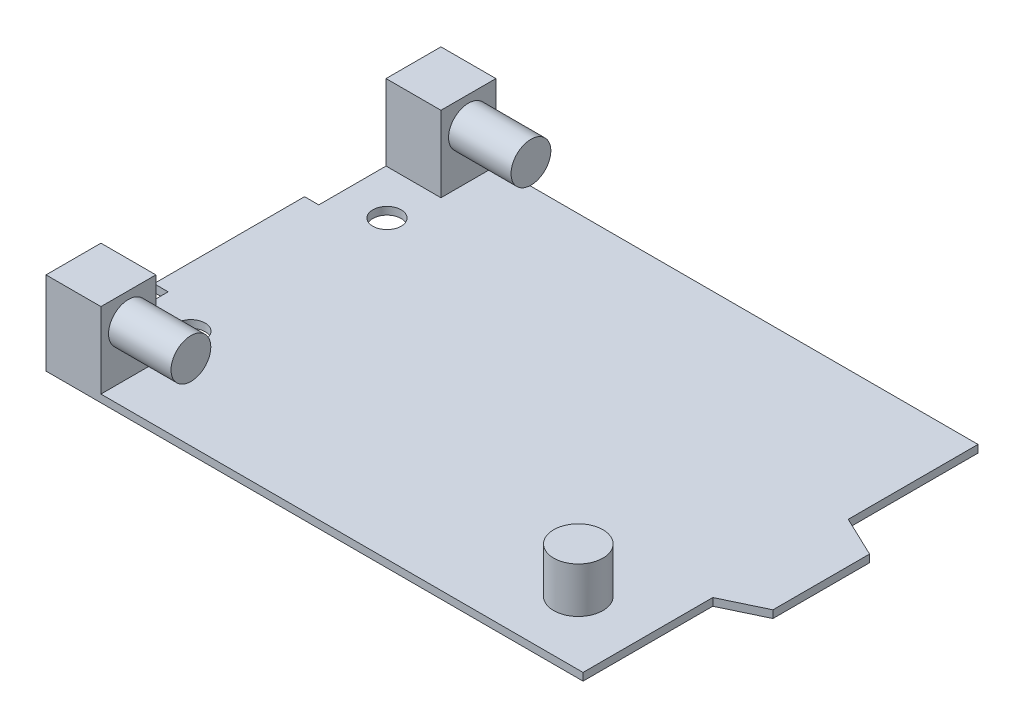
ISO-10303-21;
HEADER;
FILE_DESCRIPTION(('STEP AP214'),'2;1');
FILE_NAME('part.step','',(''),(''),'','','');
FILE_SCHEMA(('AUTOMOTIVE_DESIGN { 1 0 10303 214 1 1 1 1 }'));
ENDSEC;
DATA;
#1=APPLICATION_CONTEXT('core data for automotive mechanical design processes');
#2=APPLICATION_PROTOCOL_DEFINITION('international standard','automotive_design',2000,#1);
#3=PRODUCT_CONTEXT('',#1,'mechanical');
#4=PRODUCT('Part','Part','',(#3));
#5=PRODUCT_RELATED_PRODUCT_CATEGORY('part','',(#4));
#6=PRODUCT_DEFINITION_FORMATION('','',#4);
#7=PRODUCT_DEFINITION_CONTEXT('part definition',#1,'design');
#8=PRODUCT_DEFINITION('design','',#6,#7);
#9=PRODUCT_DEFINITION_SHAPE('','',#8);
#10=(LENGTH_UNIT() NAMED_UNIT(*) SI_UNIT(.MILLI.,.METRE.));
#11=(NAMED_UNIT(*) PLANE_ANGLE_UNIT() SI_UNIT($,.RADIAN.));
#12=(NAMED_UNIT(*) SI_UNIT($,.STERADIAN.) SOLID_ANGLE_UNIT());
#13=UNCERTAINTY_MEASURE_WITH_UNIT(LENGTH_MEASURE(1.E-05),#10,'distance_accuracy_value','');
#14=(GEOMETRIC_REPRESENTATION_CONTEXT(3) GLOBAL_UNCERTAINTY_ASSIGNED_CONTEXT((#13)) GLOBAL_UNIT_ASSIGNED_CONTEXT((#10,
#11,#12)) REPRESENTATION_CONTEXT('',''));
#15=CARTESIAN_POINT('',(0.,0.,0.));
#16=DIRECTION('',(0.,0.,1.));
#17=DIRECTION('',(1.,0.,0.));
#18=AXIS2_PLACEMENT_3D('',#15,#16,#17);
#19=CARTESIAN_POINT('',(0.,1.016,0.));
#20=DIRECTION('',(0.,-1.,0.));
#21=DIRECTION('',(0.,0.,-1.));
#22=AXIS2_PLACEMENT_3D('',#19,#20,#21);
#23=PLANE('',#22);
#24=CARTESIAN_POINT('',(64.77,1.016,7.874));
#25=DIRECTION('',(0.,-1.,0.));
#26=DIRECTION('',(0.,0.,-1.));
#27=AXIS2_PLACEMENT_3D('',#24,#25,#26);
#28=CIRCLE('',#27,3.302);
#29=CARTESIAN_POINT('',(64.77,1.016,4.572));
#30=VERTEX_POINT('',#29);
#31=EDGE_CURVE('E11',#30,#30,#28,.F.);
#32=ORIENTED_EDGE('',*,*,#31,.F.);
#33=EDGE_LOOP('',(#32));
#34=FACE_BOUND('',#33,.T.);
#35=CARTESIAN_POINT('',(8.001,1.016,3.048));
#36=DIRECTION('',(0.,1.,0.));
#37=DIRECTION('',(0.,0.,1.));
#38=AXIS2_PLACEMENT_3D('',#35,#36,#37);
#39=CIRCLE('',#38,1.905);
#40=CARTESIAN_POINT('',(8.001,1.016,4.953));
#41=VERTEX_POINT('',#40);
#42=EDGE_CURVE('E234',#41,#41,#39,.T.);
#43=ORIENTED_EDGE('',*,*,#42,.F.);
#44=EDGE_LOOP('',(#43));
#45=FACE_BOUND('',#44,.T.);
#46=CARTESIAN_POINT('',(8.00099999999999,1.016,-23.241));
#47=DIRECTION('',(0.,1.,0.));
#48=DIRECTION('',(0.,0.,1.));
#49=AXIS2_PLACEMENT_3D('',#46,#47,#48);
#50=CIRCLE('',#49,1.905);
#51=CARTESIAN_POINT('',(8.00099999999999,1.016,-21.336));
#52=VERTEX_POINT('',#51);
#53=EDGE_CURVE('E228',#52,#52,#50,.T.);
#54=ORIENTED_EDGE('',*,*,#53,.F.);
#55=EDGE_LOOP('',(#54));
#56=FACE_BOUND('',#55,.T.);
#57=DIRECTION('',(0.,0.,-1.));
#58=VECTOR('',#57,1.);
#59=CARTESIAN_POINT('',(9.271,1.016,16.383));
#60=LINE('',#59,#58);
#61=CARTESIAN_POINT('',(9.271,1.016,16.383));
#62=VERTEX_POINT('',#61);
#63=CARTESIAN_POINT('',(9.271,1.016,9.017));
#64=VERTEX_POINT('',#63);
#65=EDGE_CURVE('E174',#62,#64,#60,.T.);
#66=ORIENTED_EDGE('',*,*,#65,.F.);
#67=DIRECTION('',(1.,0.,0.));
#68=VECTOR('',#67,1.);
#69=CARTESIAN_POINT('',(1.905,1.016,16.383));
#70=LINE('',#69,#68);
#71=CARTESIAN_POINT('',(73.914,1.016,16.383));
#72=VERTEX_POINT('',#71);
#73=EDGE_CURVE('E163',#62,#72,#70,.T.);
#74=ORIENTED_EDGE('',*,*,#73,.T.);
#75=DIRECTION('',(0.,0.,-1.));
#76=VECTOR('',#75,1.);
#77=CARTESIAN_POINT('',(73.914,1.016,16.383));
#78=LINE('',#77,#76);
#79=CARTESIAN_POINT('',(73.914,1.016,-1.016));
#80=VERTEX_POINT('',#79);
#81=EDGE_CURVE('E172',#72,#80,#78,.T.);
#82=ORIENTED_EDGE('',*,*,#81,.T.);
#83=DIRECTION('',(0.902666413566439,0.,-0.430340964607255));
#84=VECTOR('',#83,1.);
#85=CARTESIAN_POINT('',(73.914,1.016,-1.016));
#86=LINE('',#85,#84);
#87=CARTESIAN_POINT('',(79.375,1.016,-3.6195));
#88=VERTEX_POINT('',#87);
#89=EDGE_CURVE('E245',#80,#88,#86,.T.);
#90=ORIENTED_EDGE('',*,*,#89,.T.);
#91=DIRECTION('',(0.,0.,-1.));
#92=VECTOR('',#91,1.);
#93=CARTESIAN_POINT('',(79.375,1.016,-3.6195));
#94=LINE('',#93,#92);
#95=CARTESIAN_POINT('',(79.375,1.016,-16.5735));
#96=VERTEX_POINT('',#95);
#97=EDGE_CURVE('E247',#88,#96,#94,.T.);
#98=ORIENTED_EDGE('',*,*,#97,.T.);
#99=DIRECTION('',(-0.902666413566438,0.,-0.430340964607256));
#100=VECTOR('',#99,1.);
#101=CARTESIAN_POINT('',(79.375,1.016,-16.5735));
#102=LINE('',#101,#100);
#103=CARTESIAN_POINT('',(73.914,1.016,-19.177));
#104=VERTEX_POINT('',#103);
#105=EDGE_CURVE('E249',#96,#104,#102,.T.);
#106=ORIENTED_EDGE('',*,*,#105,.T.);
#107=DIRECTION('',(0.,0.,-1.));
#108=VECTOR('',#107,1.);
#109=CARTESIAN_POINT('',(73.914,1.016,-19.177));
#110=LINE('',#109,#108);
#111=CARTESIAN_POINT('',(73.914,1.016,-36.576));
#112=VERTEX_POINT('',#111);
#113=EDGE_CURVE('E251',#104,#112,#110,.T.);
#114=ORIENTED_EDGE('',*,*,#113,.T.);
#115=DIRECTION('',(-1.,0.,0.));
#116=VECTOR('',#115,1.);
#117=CARTESIAN_POINT('',(73.914,1.016,-36.576));
#118=LINE('',#117,#116);
#119=CARTESIAN_POINT('',(9.271,1.016,-36.576));
#120=VERTEX_POINT('',#119);
#121=EDGE_CURVE('E253',#112,#120,#118,.T.);
#122=ORIENTED_EDGE('',*,*,#121,.T.);
#123=DIRECTION('',(0.,0.,-1.));
#124=VECTOR('',#123,1.);
#125=CARTESIAN_POINT('',(9.271,1.016,-36.576));
#126=LINE('',#125,#124);
#127=CARTESIAN_POINT('',(9.271,1.016,-29.21));
#128=VERTEX_POINT('',#127);
#129=EDGE_CURVE('E207',#128,#120,#126,.T.);
#130=ORIENTED_EDGE('',*,*,#129,.F.);
#131=DIRECTION('',(1.,0.,0.));
#132=VECTOR('',#131,1.);
#133=CARTESIAN_POINT('',(1.905,1.016,-29.21));
#134=LINE('',#133,#132);
#135=CARTESIAN_POINT('',(1.905,1.016,-29.21));
#136=VERTEX_POINT('',#135);
#137=EDGE_CURVE('E178',#136,#128,#134,.T.);
#138=ORIENTED_EDGE('',*,*,#137,.F.);
#139=DIRECTION('',(0.,0.,1.));
#140=VECTOR('',#139,1.);
#141=CARTESIAN_POINT('',(1.905,1.016,-20.193));
#142=LINE('',#141,#140);
#143=CARTESIAN_POINT('',(1.905,1.016,-20.193));
#144=VERTEX_POINT('',#143);
#145=EDGE_CURVE('E255',#136,#144,#142,.T.);
#146=ORIENTED_EDGE('',*,*,#145,.T.);
#147=DIRECTION('',(-1.,0.,0.));
#148=VECTOR('',#147,1.);
#149=CARTESIAN_POINT('',(0.,1.016,-20.193));
#150=LINE('',#149,#148);
#151=CARTESIAN_POINT('',(0.,1.016,-20.193));
#152=VERTEX_POINT('',#151);
#153=EDGE_CURVE('E257',#144,#152,#150,.T.);
#154=ORIENTED_EDGE('',*,*,#153,.T.);
#155=DIRECTION('',(0.,0.,1.));
#156=VECTOR('',#155,1.);
#157=CARTESIAN_POINT('',(0.,1.016,0.));
#158=LINE('',#157,#156);
#159=CARTESIAN_POINT('',(0.,1.016,0.));
#160=VERTEX_POINT('',#159);
#161=EDGE_CURVE('E259',#152,#160,#158,.T.);
#162=ORIENTED_EDGE('',*,*,#161,.T.);
#163=DIRECTION('',(1.,0.,0.));
#164=VECTOR('',#163,1.);
#165=CARTESIAN_POINT('',(0.,1.016,0.));
#166=LINE('',#165,#164);
#167=CARTESIAN_POINT('',(1.905,1.016,0.));
#168=VERTEX_POINT('',#167);
#169=EDGE_CURVE('E240',#160,#168,#166,.T.);
#170=ORIENTED_EDGE('',*,*,#169,.T.);
#171=DIRECTION('',(0.,0.,1.));
#172=VECTOR('',#171,1.);
#173=CARTESIAN_POINT('',(1.905,1.016,0.));
#174=LINE('',#173,#172);
#175=CARTESIAN_POINT('',(1.905,1.016,9.017));
#176=VERTEX_POINT('',#175);
#177=EDGE_CURVE('E59',#168,#176,#174,.T.);
#178=ORIENTED_EDGE('',*,*,#177,.T.);
#179=DIRECTION('',(-1.,0.,0.));
#180=VECTOR('',#179,1.);
#181=CARTESIAN_POINT('',(1.905,1.016,9.017));
#182=LINE('',#181,#180);
#183=EDGE_CURVE('E54',#64,#176,#182,.T.);
#184=ORIENTED_EDGE('',*,*,#183,.F.);
#185=EDGE_LOOP('',(#66,#74,#82,#90,#98,#106,#114,#122,#130,#138,#146,#154,#162,#170,#178,#184));
#186=FACE_BOUND('',#185,.T.);
#187=ADVANCED_FACE('F39',(#34,#45,#56,#186),#23,.F.);
#188=CARTESIAN_POINT('',(0.,0.,0.));
#189=DIRECTION('',(0.,-1.,0.));
#190=DIRECTION('',(0.,0.,-1.));
#191=AXIS2_PLACEMENT_3D('',#188,#189,#190);
#192=PLANE('',#191);
#193=CARTESIAN_POINT('',(8.001,0.,3.048));
#194=DIRECTION('',(0.,1.,0.));
#195=DIRECTION('',(0.,0.,1.));
#196=AXIS2_PLACEMENT_3D('',#193,#194,#195);
#197=CIRCLE('',#196,1.905);
#198=CARTESIAN_POINT('',(8.001,0.,4.953));
#199=VERTEX_POINT('',#198);
#200=EDGE_CURVE('E231',#199,#199,#197,.T.);
#201=ORIENTED_EDGE('',*,*,#200,.T.);
#202=EDGE_LOOP('',(#201));
#203=FACE_BOUND('',#202,.T.);
#204=DIRECTION('',(1.,0.,0.));
#205=VECTOR('',#204,1.);
#206=CARTESIAN_POINT('',(0.,0.,0.));
#207=LINE('',#206,#205);
#208=CARTESIAN_POINT('',(0.,0.,0.));
#209=VERTEX_POINT('',#208);
#210=CARTESIAN_POINT('',(1.905,0.,0.));
#211=VERTEX_POINT('',#210);
#212=EDGE_CURVE('E237',#209,#211,#207,.T.);
#213=ORIENTED_EDGE('',*,*,#212,.F.);
#214=DIRECTION('',(0.,0.,1.));
#215=VECTOR('',#214,1.);
#216=CARTESIAN_POINT('',(0.,0.,0.));
#217=LINE('',#216,#215);
#218=CARTESIAN_POINT('',(0.,0.,-20.193));
#219=VERTEX_POINT('',#218);
#220=EDGE_CURVE('E242',#219,#209,#217,.T.);
#221=ORIENTED_EDGE('',*,*,#220,.F.);
#222=DIRECTION('',(-1.,0.,0.));
#223=VECTOR('',#222,1.);
#224=CARTESIAN_POINT('',(0.,0.,-20.193));
#225=LINE('',#224,#223);
#226=CARTESIAN_POINT('',(1.905,0.,-20.193));
#227=VERTEX_POINT('',#226);
#228=EDGE_CURVE('E282',#227,#219,#225,.T.);
#229=ORIENTED_EDGE('',*,*,#228,.F.);
#230=DIRECTION('',(0.,0.,1.));
#231=VECTOR('',#230,1.);
#232=CARTESIAN_POINT('',(1.905,0.,-20.193));
#233=LINE('',#232,#231);
#234=CARTESIAN_POINT('',(1.905,0.,-36.576));
#235=VERTEX_POINT('',#234);
#236=EDGE_CURVE('E280',#235,#227,#233,.T.);
#237=ORIENTED_EDGE('',*,*,#236,.F.);
#238=DIRECTION('',(-1.,0.,0.));
#239=VECTOR('',#238,1.);
#240=CARTESIAN_POINT('',(73.914,0.,-36.576));
#241=LINE('',#240,#239);
#242=CARTESIAN_POINT('',(73.914,0.,-36.576));
#243=VERTEX_POINT('',#242);
#244=EDGE_CURVE('E278',#243,#235,#241,.T.);
#245=ORIENTED_EDGE('',*,*,#244,.F.);
#246=DIRECTION('',(0.,0.,-1.));
#247=VECTOR('',#246,1.);
#248=CARTESIAN_POINT('',(73.914,0.,-19.177));
#249=LINE('',#248,#247);
#250=CARTESIAN_POINT('',(73.914,0.,-19.177));
#251=VERTEX_POINT('',#250);
#252=EDGE_CURVE('E276',#251,#243,#249,.T.);
#253=ORIENTED_EDGE('',*,*,#252,.F.);
#254=DIRECTION('',(-0.902666413566438,0.,-0.430340964607256));
#255=VECTOR('',#254,1.);
#256=CARTESIAN_POINT('',(79.375,0.,-16.5735));
#257=LINE('',#256,#255);
#258=CARTESIAN_POINT('',(79.375,0.,-16.5735));
#259=VERTEX_POINT('',#258);
#260=EDGE_CURVE('E274',#259,#251,#257,.T.);
#261=ORIENTED_EDGE('',*,*,#260,.F.);
#262=DIRECTION('',(0.,0.,-1.));
#263=VECTOR('',#262,1.);
#264=CARTESIAN_POINT('',(79.375,0.,-3.6195));
#265=LINE('',#264,#263);
#266=CARTESIAN_POINT('',(79.375,0.,-3.6195));
#267=VERTEX_POINT('',#266);
#268=EDGE_CURVE('E272',#267,#259,#265,.T.);
#269=ORIENTED_EDGE('',*,*,#268,.F.);
#270=DIRECTION('',(0.902666413566439,0.,-0.430340964607255));
#271=VECTOR('',#270,1.);
#272=CARTESIAN_POINT('',(73.914,0.,-1.016));
#273=LINE('',#272,#271);
#274=CARTESIAN_POINT('',(73.914,0.,-1.016));
#275=VERTEX_POINT('',#274);
#276=EDGE_CURVE('E270',#275,#267,#273,.T.);
#277=ORIENTED_EDGE('',*,*,#276,.F.);
#278=DIRECTION('',(0.,0.,-1.));
#279=VECTOR('',#278,1.);
#280=CARTESIAN_POINT('',(73.914,0.,16.383));
#281=LINE('',#280,#279);
#282=CARTESIAN_POINT('',(73.914,0.,16.383));
#283=VERTEX_POINT('',#282);
#284=EDGE_CURVE('E268',#283,#275,#281,.T.);
#285=ORIENTED_EDGE('',*,*,#284,.F.);
#286=DIRECTION('',(1.,0.,0.));
#287=VECTOR('',#286,1.);
#288=CARTESIAN_POINT('',(1.905,0.,16.383));
#289=LINE('',#288,#287);
#290=CARTESIAN_POINT('',(1.905,0.,16.383));
#291=VERTEX_POINT('',#290);
#292=EDGE_CURVE('E266',#291,#283,#289,.T.);
#293=ORIENTED_EDGE('',*,*,#292,.F.);
#294=DIRECTION('',(0.,0.,1.));
#295=VECTOR('',#294,1.);
#296=CARTESIAN_POINT('',(1.905,0.,0.));
#297=LINE('',#296,#295);
#298=EDGE_CURVE('E264',#211,#291,#297,.T.);
#299=ORIENTED_EDGE('',*,*,#298,.F.);
#300=EDGE_LOOP('',(#213,#221,#229,#237,#245,#253,#261,#269,#277,#285,#293,#299));
#301=FACE_BOUND('',#300,.T.);
#302=CARTESIAN_POINT('',(8.00099999999999,0.,-23.241));
#303=DIRECTION('',(0.,1.,0.));
#304=DIRECTION('',(0.,0.,1.));
#305=AXIS2_PLACEMENT_3D('',#302,#303,#304);
#306=CIRCLE('',#305,1.905);
#307=CARTESIAN_POINT('',(8.00099999999999,0.,-21.336));
#308=VERTEX_POINT('',#307);
#309=EDGE_CURVE('E227',#308,#308,#306,.T.);
#310=ORIENTED_EDGE('',*,*,#309,.T.);
#311=EDGE_LOOP('',(#310));
#312=FACE_BOUND('',#311,.T.);
#313=ADVANCED_FACE('F373',(#203,#301,#312),#192,.T.);
#314=CARTESIAN_POINT('',(0.,1.016,0.));
#315=DIRECTION('',(0.,0.,-1.));
#316=DIRECTION('',(-1.,0.,0.));
#317=AXIS2_PLACEMENT_3D('',#314,#315,#316);
#318=PLANE('',#317);
#319=ORIENTED_EDGE('',*,*,#212,.T.);
#320=DIRECTION('',(0.,-1.,0.));
#321=VECTOR('',#320,1.);
#322=CARTESIAN_POINT('',(1.905,1.016,0.));
#323=LINE('',#322,#321);
#324=EDGE_CURVE('E315',#168,#211,#323,.T.);
#325=ORIENTED_EDGE('',*,*,#324,.F.);
#326=ORIENTED_EDGE('',*,*,#169,.F.);
#327=DIRECTION('',(0.,-1.,0.));
#328=VECTOR('',#327,1.);
#329=CARTESIAN_POINT('',(0.,1.016,0.));
#330=LINE('',#329,#328);
#331=EDGE_CURVE('E261',#160,#209,#330,.T.);
#332=ORIENTED_EDGE('',*,*,#331,.T.);
#333=EDGE_LOOP('',(#319,#325,#326,#332));
#334=FACE_BOUND('',#333,.T.);
#335=ADVANCED_FACE('F41',(#334),#318,.F.);
#336=CARTESIAN_POINT('',(1.905,1.016,0.));
#337=DIRECTION('',(1.,0.,0.));
#338=DIRECTION('',(0.,0.,-1.));
#339=AXIS2_PLACEMENT_3D('',#336,#337,#338);
#340=PLANE('',#339);
#341=ORIENTED_EDGE('',*,*,#298,.T.);
#342=DIRECTION('',(0.,-1.,0.));
#343=VECTOR('',#342,1.);
#344=CARTESIAN_POINT('',(1.905,1.016,16.383));
#345=LINE('',#344,#343);
#346=CARTESIAN_POINT('',(1.905,11.176,16.383));
#347=VERTEX_POINT('',#346);
#348=EDGE_CURVE('E312',#347,#291,#345,.T.);
#349=ORIENTED_EDGE('',*,*,#348,.F.);
#350=DIRECTION('',(0.,0.,1.));
#351=VECTOR('',#350,1.);
#352=CARTESIAN_POINT('',(1.905,11.176,16.383));
#353=LINE('',#352,#351);
#354=CARTESIAN_POINT('',(1.905,11.176,9.017));
#355=VERTEX_POINT('',#354);
#356=EDGE_CURVE('E195',#355,#347,#353,.T.);
#357=ORIENTED_EDGE('',*,*,#356,.F.);
#358=DIRECTION('',(0.,-1.,0.));
#359=VECTOR('',#358,1.);
#360=CARTESIAN_POINT('',(1.905,11.176,9.017));
#361=LINE('',#360,#359);
#362=EDGE_CURVE('E185',#355,#176,#361,.T.);
#363=ORIENTED_EDGE('',*,*,#362,.T.);
#364=ORIENTED_EDGE('',*,*,#177,.F.);
#365=ORIENTED_EDGE('',*,*,#324,.T.);
#366=EDGE_LOOP('',(#341,#349,#357,#363,#364,#365));
#367=FACE_BOUND('',#366,.T.);
#368=ADVANCED_FACE('F362',(#367),#340,.F.);
#369=CARTESIAN_POINT('',(1.905,1.016,16.383));
#370=DIRECTION('',(0.,0.,-1.));
#371=DIRECTION('',(-1.,0.,0.));
#372=AXIS2_PLACEMENT_3D('',#369,#370,#371);
#373=PLANE('',#372);
#374=ORIENTED_EDGE('',*,*,#292,.T.);
#375=DIRECTION('',(0.,-1.,0.));
#376=VECTOR('',#375,1.);
#377=CARTESIAN_POINT('',(73.914,1.016,16.383));
#378=LINE('',#377,#376);
#379=EDGE_CURVE('E170',#72,#283,#378,.T.);
#380=ORIENTED_EDGE('',*,*,#379,.F.);
#381=ORIENTED_EDGE('',*,*,#73,.F.);
#382=DIRECTION('',(0.,-1.,0.));
#383=VECTOR('',#382,1.);
#384=CARTESIAN_POINT('',(9.271,11.176,16.383));
#385=LINE('',#384,#383);
#386=CARTESIAN_POINT('',(9.271,11.176,16.383));
#387=VERTEX_POINT('',#386);
#388=EDGE_CURVE('E167',#387,#62,#385,.T.);
#389=ORIENTED_EDGE('',*,*,#388,.F.);
#390=DIRECTION('',(1.,0.,0.));
#391=VECTOR('',#390,1.);
#392=CARTESIAN_POINT('',(1.905,11.176,16.383));
#393=LINE('',#392,#391);
#394=EDGE_CURVE('E199',#347,#387,#393,.T.);
#395=ORIENTED_EDGE('',*,*,#394,.F.);
#396=ORIENTED_EDGE('',*,*,#348,.T.);
#397=EDGE_LOOP('',(#374,#380,#381,#389,#395,#396));
#398=FACE_BOUND('',#397,.T.);
#399=ADVANCED_FACE('F164',(#398),#373,.F.);
#400=CARTESIAN_POINT('',(73.914,1.016,16.383));
#401=DIRECTION('',(-1.,0.,0.));
#402=DIRECTION('',(0.,0.,1.));
#403=AXIS2_PLACEMENT_3D('',#400,#401,#402);
#404=PLANE('',#403);
#405=ORIENTED_EDGE('',*,*,#284,.T.);
#406=DIRECTION('',(0.,-1.,0.));
#407=VECTOR('',#406,1.);
#408=CARTESIAN_POINT('',(73.914,1.016,-1.016));
#409=LINE('',#408,#407);
#410=EDGE_CURVE('E308',#80,#275,#409,.T.);
#411=ORIENTED_EDGE('',*,*,#410,.F.);
#412=ORIENTED_EDGE('',*,*,#81,.F.);
#413=ORIENTED_EDGE('',*,*,#379,.T.);
#414=EDGE_LOOP('',(#405,#411,#412,#413));
#415=FACE_BOUND('',#414,.T.);
#416=ADVANCED_FACE('F379',(#415),#404,.F.);
#417=CARTESIAN_POINT('',(73.914,1.016,-1.016));
#418=DIRECTION('',(-0.430340964607255,0.,-0.902666413566439));
#419=DIRECTION('',(-0.902666413566439,0.,0.430340964607255));
#420=AXIS2_PLACEMENT_3D('',#417,#418,#419);
#421=PLANE('',#420);
#422=ORIENTED_EDGE('',*,*,#276,.T.);
#423=DIRECTION('',(0.,-1.,0.));
#424=VECTOR('',#423,1.);
#425=CARTESIAN_POINT('',(79.375,1.016,-3.6195));
#426=LINE('',#425,#424);
#427=EDGE_CURVE('E305',#88,#267,#426,.T.);
#428=ORIENTED_EDGE('',*,*,#427,.F.);
#429=ORIENTED_EDGE('',*,*,#89,.F.);
#430=ORIENTED_EDGE('',*,*,#410,.T.);
#431=EDGE_LOOP('',(#422,#428,#429,#430));
#432=FACE_BOUND('',#431,.T.);
#433=ADVANCED_FACE('F382',(#432),#421,.F.);
#434=CARTESIAN_POINT('',(79.375,1.016,-3.6195));
#435=DIRECTION('',(-1.,0.,0.));
#436=DIRECTION('',(0.,0.,1.));
#437=AXIS2_PLACEMENT_3D('',#434,#435,#436);
#438=PLANE('',#437);
#439=ORIENTED_EDGE('',*,*,#268,.T.);
#440=DIRECTION('',(0.,-1.,0.));
#441=VECTOR('',#440,1.);
#442=CARTESIAN_POINT('',(79.375,1.016,-16.5735));
#443=LINE('',#442,#441);
#444=EDGE_CURVE('E302',#96,#259,#443,.T.);
#445=ORIENTED_EDGE('',*,*,#444,.F.);
#446=ORIENTED_EDGE('',*,*,#97,.F.);
#447=ORIENTED_EDGE('',*,*,#427,.T.);
#448=EDGE_LOOP('',(#439,#445,#446,#447));
#449=FACE_BOUND('',#448,.T.);
#450=ADVANCED_FACE('F389',(#449),#438,.F.);
#451=CARTESIAN_POINT('',(79.375,1.016,-16.5735));
#452=DIRECTION('',(-0.430340964607256,0.,0.902666413566439));
#453=DIRECTION('',(0.902666413566439,0.,0.430340964607256));
#454=AXIS2_PLACEMENT_3D('',#451,#452,#453);
#455=PLANE('',#454);
#456=ORIENTED_EDGE('',*,*,#260,.T.);
#457=DIRECTION('',(0.,-1.,0.));
#458=VECTOR('',#457,1.);
#459=CARTESIAN_POINT('',(73.914,1.016,-19.177));
#460=LINE('',#459,#458);
#461=EDGE_CURVE('E299',#104,#251,#460,.T.);
#462=ORIENTED_EDGE('',*,*,#461,.F.);
#463=ORIENTED_EDGE('',*,*,#105,.F.);
#464=ORIENTED_EDGE('',*,*,#444,.T.);
#465=EDGE_LOOP('',(#456,#462,#463,#464));
#466=FACE_BOUND('',#465,.T.);
#467=ADVANCED_FACE('F392',(#466),#455,.F.);
#468=CARTESIAN_POINT('',(73.914,1.016,-19.177));
#469=DIRECTION('',(-1.,0.,0.));
#470=DIRECTION('',(0.,0.,1.));
#471=AXIS2_PLACEMENT_3D('',#468,#469,#470);
#472=PLANE('',#471);
#473=ORIENTED_EDGE('',*,*,#252,.T.);
#474=DIRECTION('',(0.,-1.,0.));
#475=VECTOR('',#474,1.);
#476=CARTESIAN_POINT('',(73.914,1.016,-36.576));
#477=LINE('',#476,#475);
#478=EDGE_CURVE('E296',#112,#243,#477,.T.);
#479=ORIENTED_EDGE('',*,*,#478,.F.);
#480=ORIENTED_EDGE('',*,*,#113,.F.);
#481=ORIENTED_EDGE('',*,*,#461,.T.);
#482=EDGE_LOOP('',(#473,#479,#480,#481));
#483=FACE_BOUND('',#482,.T.);
#484=ADVANCED_FACE('F397',(#483),#472,.F.);
#485=CARTESIAN_POINT('',(73.914,1.016,-36.576));
#486=DIRECTION('',(0.,0.,1.));
#487=DIRECTION('',(1.,0.,0.));
#488=AXIS2_PLACEMENT_3D('',#485,#486,#487);
#489=PLANE('',#488);
#490=ORIENTED_EDGE('',*,*,#244,.T.);
#491=DIRECTION('',(0.,-1.,0.));
#492=VECTOR('',#491,1.);
#493=CARTESIAN_POINT('',(1.905,1.016,-36.576));
#494=LINE('',#493,#492);
#495=CARTESIAN_POINT('',(1.905,11.176,-36.576));
#496=VERTEX_POINT('',#495);
#497=EDGE_CURVE('E293',#496,#235,#494,.T.);
#498=ORIENTED_EDGE('',*,*,#497,.F.);
#499=DIRECTION('',(-1.,0.,0.));
#500=VECTOR('',#499,1.);
#501=CARTESIAN_POINT('',(1.905,11.176,-36.576));
#502=LINE('',#501,#500);
#503=CARTESIAN_POINT('',(9.271,11.176,-36.576));
#504=VERTEX_POINT('',#503);
#505=EDGE_CURVE('E211',#504,#496,#502,.T.);
#506=ORIENTED_EDGE('',*,*,#505,.F.);
#507=DIRECTION('',(0.,-1.,0.));
#508=VECTOR('',#507,1.);
#509=CARTESIAN_POINT('',(9.271,11.176,-36.576));
#510=LINE('',#509,#508);
#511=EDGE_CURVE('E214',#504,#120,#510,.T.);
#512=ORIENTED_EDGE('',*,*,#511,.T.);
#513=ORIENTED_EDGE('',*,*,#121,.F.);
#514=ORIENTED_EDGE('',*,*,#478,.T.);
#515=EDGE_LOOP('',(#490,#498,#506,#512,#513,#514));
#516=FACE_BOUND('',#515,.T.);
#517=ADVANCED_FACE('F337',(#516),#489,.F.);
#518=CARTESIAN_POINT('',(1.905,1.016,-20.193));
#519=DIRECTION('',(1.,0.,0.));
#520=DIRECTION('',(0.,0.,-1.));
#521=AXIS2_PLACEMENT_3D('',#518,#519,#520);
#522=PLANE('',#521);
#523=ORIENTED_EDGE('',*,*,#236,.T.);
#524=DIRECTION('',(0.,-1.,0.));
#525=VECTOR('',#524,1.);
#526=CARTESIAN_POINT('',(1.905,1.016,-20.193));
#527=LINE('',#526,#525);
#528=EDGE_CURVE('E290',#144,#227,#527,.T.);
#529=ORIENTED_EDGE('',*,*,#528,.F.);
#530=ORIENTED_EDGE('',*,*,#145,.F.);
#531=DIRECTION('',(0.,-1.,0.));
#532=VECTOR('',#531,1.);
#533=CARTESIAN_POINT('',(1.905,11.176,-29.21));
#534=LINE('',#533,#532);
#535=CARTESIAN_POINT('',(1.905,11.176,-29.21));
#536=VERTEX_POINT('',#535);
#537=EDGE_CURVE('E224',#536,#136,#534,.T.);
#538=ORIENTED_EDGE('',*,*,#537,.F.);
#539=DIRECTION('',(0.,0.,1.));
#540=VECTOR('',#539,1.);
#541=CARTESIAN_POINT('',(1.905,11.176,-36.576));
#542=LINE('',#541,#540);
#543=EDGE_CURVE('E203',#496,#536,#542,.T.);
#544=ORIENTED_EDGE('',*,*,#543,.F.);
#545=ORIENTED_EDGE('',*,*,#497,.T.);
#546=EDGE_LOOP('',(#523,#529,#530,#538,#544,#545));
#547=FACE_BOUND('',#546,.T.);
#548=ADVANCED_FACE('F342',(#547),#522,.F.);
#549=CARTESIAN_POINT('',(0.,1.016,-20.193));
#550=DIRECTION('',(0.,0.,1.));
#551=DIRECTION('',(1.,0.,0.));
#552=AXIS2_PLACEMENT_3D('',#549,#550,#551);
#553=PLANE('',#552);
#554=ORIENTED_EDGE('',*,*,#228,.T.);
#555=DIRECTION('',(0.,-1.,0.));
#556=VECTOR('',#555,1.);
#557=CARTESIAN_POINT('',(0.,1.016,-20.193));
#558=LINE('',#557,#556);
#559=EDGE_CURVE('E287',#152,#219,#558,.T.);
#560=ORIENTED_EDGE('',*,*,#559,.F.);
#561=ORIENTED_EDGE('',*,*,#153,.F.);
#562=ORIENTED_EDGE('',*,*,#528,.T.);
#563=EDGE_LOOP('',(#554,#560,#561,#562));
#564=FACE_BOUND('',#563,.T.);
#565=ADVANCED_FACE('F351',(#564),#553,.F.);
#566=CARTESIAN_POINT('',(0.,1.016,0.));
#567=DIRECTION('',(1.,0.,0.));
#568=DIRECTION('',(0.,0.,-1.));
#569=AXIS2_PLACEMENT_3D('',#566,#567,#568);
#570=PLANE('',#569);
#571=ORIENTED_EDGE('',*,*,#220,.T.);
#572=ORIENTED_EDGE('',*,*,#331,.F.);
#573=ORIENTED_EDGE('',*,*,#161,.F.);
#574=ORIENTED_EDGE('',*,*,#559,.T.);
#575=EDGE_LOOP('',(#571,#572,#573,#574));
#576=FACE_BOUND('',#575,.T.);
#577=ADVANCED_FACE('F356',(#576),#570,.F.);
#578=CARTESIAN_POINT('',(8.001,1.016,3.048));
#579=DIRECTION('',(0.,-1.,0.));
#580=DIRECTION('',(0.,0.,-1.));
#581=AXIS2_PLACEMENT_3D('',#578,#579,#580);
#582=CYLINDRICAL_SURFACE('',#581,1.905);
#583=ORIENTED_EDGE('',*,*,#42,.T.);
#584=EDGE_LOOP('',(#583));
#585=FACE_BOUND('',#584,.T.);
#586=ORIENTED_EDGE('',*,*,#200,.F.);
#587=EDGE_LOOP('',(#586));
#588=FACE_BOUND('',#587,.T.);
#589=ADVANCED_FACE('F418',(#585,#588),#582,.F.);
#590=CARTESIAN_POINT('',(8.00099999999999,1.016,-23.241));
#591=DIRECTION('',(0.,-1.,0.));
#592=DIRECTION('',(0.,0.,-1.));
#593=AXIS2_PLACEMENT_3D('',#590,#591,#592);
#594=CYLINDRICAL_SURFACE('',#593,1.905);
#595=ORIENTED_EDGE('',*,*,#53,.T.);
#596=EDGE_LOOP('',(#595));
#597=FACE_BOUND('',#596,.T.);
#598=ORIENTED_EDGE('',*,*,#309,.F.);
#599=EDGE_LOOP('',(#598));
#600=FACE_BOUND('',#599,.T.);
#601=ADVANCED_FACE('F445',(#597,#600),#594,.F.);
#602=CARTESIAN_POINT('',(1.905,11.176,-29.21));
#603=DIRECTION('',(0.,0.,-1.));
#604=DIRECTION('',(-1.,0.,0.));
#605=AXIS2_PLACEMENT_3D('',#602,#603,#604);
#606=PLANE('',#605);
#607=ORIENTED_EDGE('',*,*,#137,.T.);
#608=DIRECTION('',(0.,-1.,0.));
#609=VECTOR('',#608,1.);
#610=CARTESIAN_POINT('',(9.271,11.176,-29.21));
#611=LINE('',#610,#609);
#612=CARTESIAN_POINT('',(9.271,11.176,-29.21));
#613=VERTEX_POINT('',#612);
#614=EDGE_CURVE('E221',#613,#128,#611,.T.);
#615=ORIENTED_EDGE('',*,*,#614,.F.);
#616=DIRECTION('',(1.,0.,0.));
#617=VECTOR('',#616,1.);
#618=CARTESIAN_POINT('',(1.905,11.176,-29.21));
#619=LINE('',#618,#617);
#620=EDGE_CURVE('E206',#536,#613,#619,.T.);
#621=ORIENTED_EDGE('',*,*,#620,.F.);
#622=ORIENTED_EDGE('',*,*,#537,.T.);
#623=EDGE_LOOP('',(#607,#615,#621,#622));
#624=FACE_BOUND('',#623,.T.);
#625=ADVANCED_FACE('F329',(#624),#606,.F.);
#626=CARTESIAN_POINT('',(9.271,11.176,-36.576));
#627=DIRECTION('',(-1.,0.,0.));
#628=DIRECTION('',(0.,0.,1.));
#629=AXIS2_PLACEMENT_3D('',#626,#627,#628);
#630=PLANE('',#629);
#631=CARTESIAN_POINT('',(9.271,7.493,-32.893));
#632=DIRECTION('',(-1.,0.,0.));
#633=DIRECTION('',(0.,0.,1.));
#634=AXIS2_PLACEMENT_3D('',#631,#632,#633);
#635=CIRCLE('',#634,2.667);
#636=CARTESIAN_POINT('',(9.271,7.493,-30.226));
#637=VERTEX_POINT('',#636);
#638=EDGE_CURVE('E47',#637,#637,#635,.F.);
#639=ORIENTED_EDGE('',*,*,#638,.F.);
#640=EDGE_LOOP('',(#639));
#641=FACE_BOUND('',#640,.T.);
#642=ORIENTED_EDGE('',*,*,#129,.T.);
#643=ORIENTED_EDGE('',*,*,#511,.F.);
#644=DIRECTION('',(0.,0.,-1.));
#645=VECTOR('',#644,1.);
#646=CARTESIAN_POINT('',(9.271,11.176,-36.576));
#647=LINE('',#646,#645);
#648=EDGE_CURVE('E209',#613,#504,#647,.T.);
#649=ORIENTED_EDGE('',*,*,#648,.F.);
#650=ORIENTED_EDGE('',*,*,#614,.T.);
#651=EDGE_LOOP('',(#642,#643,#649,#650));
#652=FACE_BOUND('',#651,.T.);
#653=ADVANCED_FACE('F325',(#641,#652),#630,.F.);
#654=CARTESIAN_POINT('',(0.,11.176,0.));
#655=DIRECTION('',(0.,1.,0.));
#656=DIRECTION('',(0.,0.,1.));
#657=AXIS2_PLACEMENT_3D('',#654,#655,#656);
#658=PLANE('',#657);
#659=ORIENTED_EDGE('',*,*,#543,.T.);
#660=ORIENTED_EDGE('',*,*,#620,.T.);
#661=ORIENTED_EDGE('',*,*,#648,.T.);
#662=ORIENTED_EDGE('',*,*,#505,.T.);
#663=EDGE_LOOP('',(#659,#660,#661,#662));
#664=FACE_BOUND('',#663,.T.);
#665=ADVANCED_FACE('F328',(#664),#658,.T.);
#666=CARTESIAN_POINT('',(9.271,11.176,16.383));
#667=DIRECTION('',(-1.,0.,0.));
#668=DIRECTION('',(0.,0.,1.));
#669=AXIS2_PLACEMENT_3D('',#666,#667,#668);
#670=PLANE('',#669);
#671=CARTESIAN_POINT('',(9.271,7.493,12.7));
#672=DIRECTION('',(-1.,0.,0.));
#673=DIRECTION('',(0.,0.,1.));
#674=AXIS2_PLACEMENT_3D('',#671,#672,#673);
#675=CIRCLE('',#674,2.667);
#676=CARTESIAN_POINT('',(9.271,7.493,15.367));
#677=VERTEX_POINT('',#676);
#678=EDGE_CURVE('E318',#677,#677,#675,.F.);
#679=ORIENTED_EDGE('',*,*,#678,.F.);
#680=EDGE_LOOP('',(#679));
#681=FACE_BOUND('',#680,.T.);
#682=ORIENTED_EDGE('',*,*,#65,.T.);
#683=DIRECTION('',(0.,-1.,0.));
#684=VECTOR('',#683,1.);
#685=CARTESIAN_POINT('',(9.271,11.176,9.017));
#686=LINE('',#685,#684);
#687=CARTESIAN_POINT('',(9.271,11.176,9.017));
#688=VERTEX_POINT('',#687);
#689=EDGE_CURVE('E182',#688,#64,#686,.T.);
#690=ORIENTED_EDGE('',*,*,#689,.F.);
#691=DIRECTION('',(0.,0.,-1.));
#692=VECTOR('',#691,1.);
#693=CARTESIAN_POINT('',(9.271,11.176,16.383));
#694=LINE('',#693,#692);
#695=EDGE_CURVE('E181',#387,#688,#694,.T.);
#696=ORIENTED_EDGE('',*,*,#695,.F.);
#697=ORIENTED_EDGE('',*,*,#388,.T.);
#698=EDGE_LOOP('',(#682,#690,#696,#697));
#699=FACE_BOUND('',#698,.T.);
#700=ADVANCED_FACE('F180',(#681,#699),#670,.F.);
#701=CARTESIAN_POINT('',(1.905,11.176,9.017));
#702=DIRECTION('',(0.,0.,1.));
#703=DIRECTION('',(1.,0.,0.));
#704=AXIS2_PLACEMENT_3D('',#701,#702,#703);
#705=PLANE('',#704);
#706=ORIENTED_EDGE('',*,*,#183,.T.);
#707=ORIENTED_EDGE('',*,*,#362,.F.);
#708=DIRECTION('',(-1.,0.,0.));
#709=VECTOR('',#708,1.);
#710=CARTESIAN_POINT('',(1.905,11.176,9.017));
#711=LINE('',#710,#709);
#712=EDGE_CURVE('E194',#688,#355,#711,.T.);
#713=ORIENTED_EDGE('',*,*,#712,.F.);
#714=ORIENTED_EDGE('',*,*,#689,.T.);
#715=EDGE_LOOP('',(#706,#707,#713,#714));
#716=FACE_BOUND('',#715,.T.);
#717=ADVANCED_FACE('F367',(#716),#705,.F.);
#718=CARTESIAN_POINT('',(0.,11.176,0.));
#719=DIRECTION('',(0.,-1.,0.));
#720=DIRECTION('',(0.,0.,-1.));
#721=AXIS2_PLACEMENT_3D('',#718,#719,#720);
#722=PLANE('',#721);
#723=ORIENTED_EDGE('',*,*,#356,.T.);
#724=ORIENTED_EDGE('',*,*,#394,.T.);
#725=ORIENTED_EDGE('',*,*,#695,.T.);
#726=ORIENTED_EDGE('',*,*,#712,.T.);
#727=EDGE_LOOP('',(#723,#724,#725,#726));
#728=FACE_BOUND('',#727,.T.);
#729=ADVANCED_FACE('F369',(#728),#722,.F.);
#730=CARTESIAN_POINT('',(17.653,7.493,12.7));
#731=DIRECTION('',(-1.,0.,0.));
#732=DIRECTION('',(0.,0.,1.));
#733=AXIS2_PLACEMENT_3D('',#730,#731,#732);
#734=CYLINDRICAL_SURFACE('',#733,2.667);
#735=CARTESIAN_POINT('',(17.653,7.493,12.7));
#736=DIRECTION('',(1.,0.,0.));
#737=DIRECTION('',(0.,0.,-1.));
#738=AXIS2_PLACEMENT_3D('',#735,#736,#737);
#739=CIRCLE('',#738,2.667);
#740=CARTESIAN_POINT('',(17.653,7.493,10.033));
#741=VERTEX_POINT('',#740);
#742=EDGE_CURVE('E183',#741,#741,#739,.T.);
#743=ORIENTED_EDGE('',*,*,#742,.F.);
#744=EDGE_LOOP('',(#743));
#745=FACE_BOUND('',#744,.T.);
#746=ORIENTED_EDGE('',*,*,#678,.T.);
#747=EDGE_LOOP('',(#746));
#748=FACE_BOUND('',#747,.T.);
#749=ADVANCED_FACE('F492',(#745,#748),#734,.T.);
#750=CARTESIAN_POINT('',(17.653,0.,0.));
#751=DIRECTION('',(1.,0.,0.));
#752=DIRECTION('',(0.,0.,-1.));
#753=AXIS2_PLACEMENT_3D('',#750,#751,#752);
#754=PLANE('',#753);
#755=ORIENTED_EDGE('',*,*,#742,.T.);
#756=EDGE_LOOP('',(#755));
#757=FACE_BOUND('',#756,.T.);
#758=ADVANCED_FACE('F499',(#757),#754,.T.);
#759=CARTESIAN_POINT('',(17.653,7.493,-32.893));
#760=DIRECTION('',(-1.,0.,0.));
#761=DIRECTION('',(0.,0.,1.));
#762=AXIS2_PLACEMENT_3D('',#759,#760,#761);
#763=CYLINDRICAL_SURFACE('',#762,2.667);
#764=CARTESIAN_POINT('',(17.653,7.493,-32.893));
#765=DIRECTION('',(1.,0.,0.));
#766=DIRECTION('',(0.,0.,-1.));
#767=AXIS2_PLACEMENT_3D('',#764,#765,#766);
#768=CIRCLE('',#767,2.667);
#769=CARTESIAN_POINT('',(17.653,7.493,-35.56));
#770=VERTEX_POINT('',#769);
#771=EDGE_CURVE('E188',#770,#770,#768,.T.);
#772=ORIENTED_EDGE('',*,*,#771,.F.);
#773=EDGE_LOOP('',(#772));
#774=FACE_BOUND('',#773,.T.);
#775=ORIENTED_EDGE('',*,*,#638,.T.);
#776=EDGE_LOOP('',(#775));
#777=FACE_BOUND('',#776,.T.);
#778=ADVANCED_FACE('F323',(#774,#777),#763,.T.);
#779=CARTESIAN_POINT('',(17.653,0.,0.));
#780=DIRECTION('',(1.,0.,0.));
#781=DIRECTION('',(0.,0.,-1.));
#782=AXIS2_PLACEMENT_3D('',#779,#780,#781);
#783=PLANE('',#782);
#784=ORIENTED_EDGE('',*,*,#771,.T.);
#785=EDGE_LOOP('',(#784));
#786=FACE_BOUND('',#785,.T.);
#787=ADVANCED_FACE('F512',(#786),#783,.T.);
#788=CARTESIAN_POINT('',(64.77,7.112,7.874));
#789=DIRECTION('',(0.,-1.,0.));
#790=DIRECTION('',(0.,0.,-1.));
#791=AXIS2_PLACEMENT_3D('',#788,#789,#790);
#792=CYLINDRICAL_SURFACE('',#791,3.302);
#793=CARTESIAN_POINT('',(64.77,7.112,7.874));
#794=DIRECTION('',(0.,1.,0.));
#795=DIRECTION('',(0.,0.,1.));
#796=AXIS2_PLACEMENT_3D('',#793,#794,#795);
#797=CIRCLE('',#796,3.302);
#798=CARTESIAN_POINT('',(64.77,7.112,11.176));
#799=VERTEX_POINT('',#798);
#800=EDGE_CURVE('E741',#799,#799,#797,.T.);
#801=ORIENTED_EDGE('',*,*,#800,.F.);
#802=EDGE_LOOP('',(#801));
#803=FACE_BOUND('',#802,.T.);
#804=ORIENTED_EDGE('',*,*,#31,.T.);
#805=EDGE_LOOP('',(#804));
#806=FACE_BOUND('',#805,.T.);
#807=ADVANCED_FACE('F519',(#803,#806),#792,.T.);
#808=CARTESIAN_POINT('',(0.,7.112,0.));
#809=DIRECTION('',(0.,1.,0.));
#810=DIRECTION('',(0.,0.,1.));
#811=AXIS2_PLACEMENT_3D('',#808,#809,#810);
#812=PLANE('',#811);
#813=ORIENTED_EDGE('',*,*,#800,.T.);
#814=EDGE_LOOP('',(#813));
#815=FACE_BOUND('',#814,.T.);
#816=ADVANCED_FACE('F526',(#815),#812,.T.);
#817=CLOSED_SHELL('',(#187,#313,#335,#368,#399,#416,#433,#450,#467,#484,#517,#548,#565,#577,
#589,#601,#625,#653,#665,#700,#717,#729,#749,#758,#778,#787,#807,#816));
#818=MANIFOLD_SOLID_BREP('B2',#817);
#819=ADVANCED_BREP_SHAPE_REPRESENTATION('',(#18,#818),#14);
#820=SHAPE_DEFINITION_REPRESENTATION(#9,#819);
ENDSEC;
END-ISO-10303-21;
